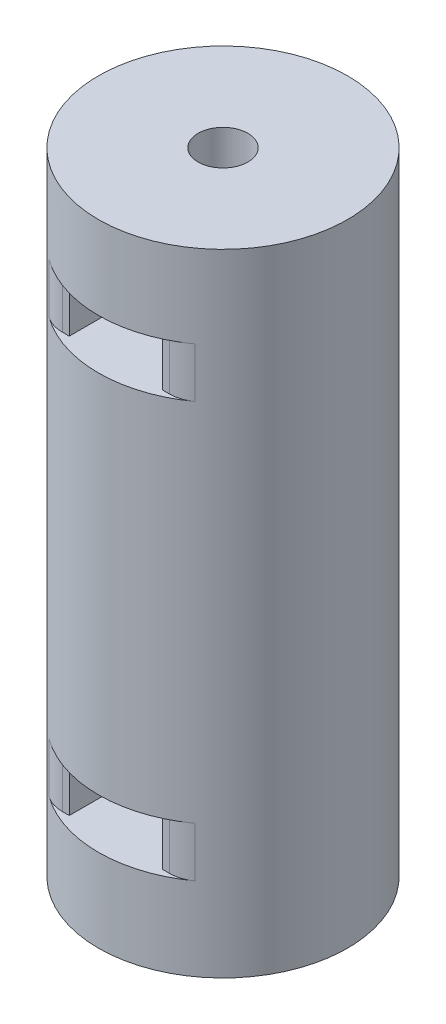
ISO-10303-21;
HEADER;
FILE_DESCRIPTION(('STEP AP214'),'2;1');
FILE_NAME('part.step','',(''),(''),'','','');
FILE_SCHEMA(('AUTOMOTIVE_DESIGN { 1 0 10303 214 1 1 1 1 }'));
ENDSEC;
DATA;
#1=APPLICATION_CONTEXT('core data for automotive mechanical design processes');
#2=APPLICATION_PROTOCOL_DEFINITION('international standard','automotive_design',2000,#1);
#3=PRODUCT_CONTEXT('',#1,'mechanical');
#4=PRODUCT('Part','Part','',(#3));
#5=PRODUCT_RELATED_PRODUCT_CATEGORY('part','',(#4));
#6=PRODUCT_DEFINITION_FORMATION('','',#4);
#7=PRODUCT_DEFINITION_CONTEXT('part definition',#1,'design');
#8=PRODUCT_DEFINITION('design','',#6,#7);
#9=PRODUCT_DEFINITION_SHAPE('','',#8);
#10=(LENGTH_UNIT() NAMED_UNIT(*) SI_UNIT(.MILLI.,.METRE.));
#11=(NAMED_UNIT(*) PLANE_ANGLE_UNIT() SI_UNIT($,.RADIAN.));
#12=(NAMED_UNIT(*) SI_UNIT($,.STERADIAN.) SOLID_ANGLE_UNIT());
#13=UNCERTAINTY_MEASURE_WITH_UNIT(LENGTH_MEASURE(1.E-05),#10,'distance_accuracy_value','');
#14=(GEOMETRIC_REPRESENTATION_CONTEXT(3) GLOBAL_UNCERTAINTY_ASSIGNED_CONTEXT((#13)) GLOBAL_UNIT_ASSIGNED_CONTEXT((#10,
#11,#12)) REPRESENTATION_CONTEXT('',''));
#15=CARTESIAN_POINT('',(0.,0.,0.));
#16=DIRECTION('',(0.,0.,1.));
#17=DIRECTION('',(1.,0.,0.));
#18=AXIS2_PLACEMENT_3D('',#15,#16,#17);
#19=CARTESIAN_POINT('',(0.,38.,0.));
#20=DIRECTION('',(0.,-1.,0.));
#21=DIRECTION('',(0.,0.,-1.));
#22=AXIS2_PLACEMENT_3D('',#19,#20,#21);
#23=CYLINDRICAL_SURFACE('',#22,7.5);
#24=CARTESIAN_POINT('',(0.,38.,0.));
#25=DIRECTION('',(0.,1.,0.));
#26=DIRECTION('',(0.,0.,1.));
#27=AXIS2_PLACEMENT_3D('',#24,#25,#26);
#28=CIRCLE('',#27,7.5);
#29=CARTESIAN_POINT('',(0.,38.,7.5));
#30=VERTEX_POINT('',#29);
#31=EDGE_CURVE('E264',#30,#30,#28,.T.);
#32=ORIENTED_EDGE('',*,*,#31,.F.);
#33=EDGE_LOOP('',(#32));
#34=FACE_BOUND('',#33,.T.);
#35=CARTESIAN_POINT('',(0.,0.,0.));
#36=DIRECTION('',(0.,1.,0.));
#37=DIRECTION('',(0.,0.,1.));
#38=AXIS2_PLACEMENT_3D('',#35,#36,#37);
#39=CIRCLE('',#38,7.5);
#40=CARTESIAN_POINT('',(0.,0.,7.5));
#41=VERTEX_POINT('',#40);
#42=EDGE_CURVE('E260',#41,#41,#39,.T.);
#43=ORIENTED_EDGE('',*,*,#42,.T.);
#44=EDGE_LOOP('',(#43));
#45=FACE_BOUND('',#44,.T.);
#46=DIRECTION('',(0.,-1.,0.));
#47=VECTOR('',#46,1.);
#48=CARTESIAN_POINT('',(-4.39307842521377,38.,6.07872206552671));
#49=LINE('',#48,#47);
#50=CARTESIAN_POINT('',(-4.39307842521377,30.,6.07872206552671));
#51=VERTEX_POINT('',#50);
#52=CARTESIAN_POINT('',(-4.39307842521377,33.,6.07872206552671));
#53=VERTEX_POINT('',#52);
#54=EDGE_CURVE('E286',#51,#53,#49,.F.);
#55=ORIENTED_EDGE('',*,*,#54,.T.);
#56=CARTESIAN_POINT('',(0.,33.,0.));
#57=DIRECTION('',(0.,-1.,0.));
#58=DIRECTION('',(0.,0.,-1.));
#59=AXIS2_PLACEMENT_3D('',#56,#57,#58);
#60=CIRCLE('',#59,7.5);
#61=CARTESIAN_POINT('',(4.39307842521378,33.,6.0787220655267));
#62=VERTEX_POINT('',#61);
#63=EDGE_CURVE('E252',#62,#53,#60,.T.);
#64=ORIENTED_EDGE('',*,*,#63,.F.);
#65=DIRECTION('',(0.,-1.,0.));
#66=VECTOR('',#65,1.);
#67=CARTESIAN_POINT('',(4.39307842521378,38.,6.0787220655267));
#68=LINE('',#67,#66);
#69=CARTESIAN_POINT('',(4.39307842521378,30.,6.0787220655267));
#70=VERTEX_POINT('',#69);
#71=EDGE_CURVE('E283',#62,#70,#68,.T.);
#72=ORIENTED_EDGE('',*,*,#71,.T.);
#73=CARTESIAN_POINT('',(0.,30.,0.));
#74=DIRECTION('',(0.,-1.,0.));
#75=DIRECTION('',(0.,0.,-1.));
#76=AXIS2_PLACEMENT_3D('',#73,#74,#75);
#77=CIRCLE('',#76,7.5);
#78=EDGE_CURVE('E255',#70,#51,#77,.T.);
#79=ORIENTED_EDGE('',*,*,#78,.T.);
#80=EDGE_LOOP('',(#55,#64,#72,#79));
#81=FACE_BOUND('',#80,.T.);
#82=DIRECTION('',(0.,-1.,0.));
#83=VECTOR('',#82,1.);
#84=CARTESIAN_POINT('',(4.39307842521378,38.,-6.0787220655267));
#85=LINE('',#84,#83);
#86=CARTESIAN_POINT('',(4.39307842521378,30.,-6.0787220655267));
#87=VERTEX_POINT('',#86);
#88=CARTESIAN_POINT('',(4.39307842521378,33.,-6.0787220655267));
#89=VERTEX_POINT('',#88);
#90=EDGE_CURVE('E292',#87,#89,#85,.F.);
#91=ORIENTED_EDGE('',*,*,#90,.T.);
#92=CARTESIAN_POINT('',(-4.39307842521378,33.,-6.0787220655267));
#93=VERTEX_POINT('',#92);
#94=EDGE_CURVE('E250',#93,#89,#60,.T.);
#95=ORIENTED_EDGE('',*,*,#94,.F.);
#96=DIRECTION('',(0.,-1.,0.));
#97=VECTOR('',#96,1.);
#98=CARTESIAN_POINT('',(-4.39307842521378,38.,-6.0787220655267));
#99=LINE('',#98,#97);
#100=CARTESIAN_POINT('',(-4.39307842521378,30.,-6.0787220655267));
#101=VERTEX_POINT('',#100);
#102=EDGE_CURVE('E289',#93,#101,#99,.T.);
#103=ORIENTED_EDGE('',*,*,#102,.T.);
#104=EDGE_CURVE('E253',#101,#87,#77,.T.);
#105=ORIENTED_EDGE('',*,*,#104,.T.);
#106=EDGE_LOOP('',(#91,#95,#103,#105));
#107=FACE_BOUND('',#106,.T.);
#108=DIRECTION('',(0.,-1.,0.));
#109=VECTOR('',#108,1.);
#110=CARTESIAN_POINT('',(4.39307842521378,38.,6.0787220655267));
#111=LINE('',#110,#109);
#112=CARTESIAN_POINT('',(4.39307842521378,8.,6.0787220655267));
#113=VERTEX_POINT('',#112);
#114=CARTESIAN_POINT('',(4.39307842521378,5.,6.0787220655267));
#115=VERTEX_POINT('',#114);
#116=EDGE_CURVE('E280',#113,#115,#111,.T.);
#117=ORIENTED_EDGE('',*,*,#116,.T.);
#118=CARTESIAN_POINT('',(0.,5.,0.));
#119=DIRECTION('',(0.,-1.,0.));
#120=DIRECTION('',(0.,0.,-1.));
#121=AXIS2_PLACEMENT_3D('',#118,#119,#120);
#122=CIRCLE('',#121,7.5);
#123=CARTESIAN_POINT('',(-4.39307842521377,5.,6.07872206552671));
#124=VERTEX_POINT('',#123);
#125=EDGE_CURVE('E231',#115,#124,#122,.T.);
#126=ORIENTED_EDGE('',*,*,#125,.T.);
#127=DIRECTION('',(0.,-1.,0.));
#128=VECTOR('',#127,1.);
#129=CARTESIAN_POINT('',(-4.39307842521377,38.,6.07872206552671));
#130=LINE('',#129,#128);
#131=CARTESIAN_POINT('',(-4.39307842521377,8.,6.07872206552671));
#132=VERTEX_POINT('',#131);
#133=EDGE_CURVE('E267',#124,#132,#130,.F.);
#134=ORIENTED_EDGE('',*,*,#133,.T.);
#135=CARTESIAN_POINT('',(0.,8.,0.));
#136=DIRECTION('',(0.,-1.,0.));
#137=DIRECTION('',(0.,0.,-1.));
#138=AXIS2_PLACEMENT_3D('',#135,#136,#137);
#139=CIRCLE('',#138,7.5);
#140=EDGE_CURVE('E235',#113,#132,#139,.T.);
#141=ORIENTED_EDGE('',*,*,#140,.F.);
#142=EDGE_LOOP('',(#117,#126,#134,#141));
#143=FACE_BOUND('',#142,.T.);
#144=DIRECTION('',(0.,-1.,0.));
#145=VECTOR('',#144,1.);
#146=CARTESIAN_POINT('',(-4.39307842521378,38.,-6.0787220655267));
#147=LINE('',#146,#145);
#148=CARTESIAN_POINT('',(-4.39307842521378,8.,-6.0787220655267));
#149=VERTEX_POINT('',#148);
#150=CARTESIAN_POINT('',(-4.39307842521378,5.,-6.0787220655267));
#151=VERTEX_POINT('',#150);
#152=EDGE_CURVE('E298',#149,#151,#147,.T.);
#153=ORIENTED_EDGE('',*,*,#152,.T.);
#154=CARTESIAN_POINT('',(4.39307842521378,5.,-6.0787220655267));
#155=VERTEX_POINT('',#154);
#156=EDGE_CURVE('E229',#151,#155,#122,.T.);
#157=ORIENTED_EDGE('',*,*,#156,.T.);
#158=DIRECTION('',(0.,-1.,0.));
#159=VECTOR('',#158,1.);
#160=CARTESIAN_POINT('',(4.39307842521378,38.,-6.0787220655267));
#161=LINE('',#160,#159);
#162=CARTESIAN_POINT('',(4.39307842521378,8.,-6.0787220655267));
#163=VERTEX_POINT('',#162);
#164=EDGE_CURVE('E295',#155,#163,#161,.F.);
#165=ORIENTED_EDGE('',*,*,#164,.T.);
#166=EDGE_CURVE('E233',#149,#163,#139,.T.);
#167=ORIENTED_EDGE('',*,*,#166,.F.);
#168=EDGE_LOOP('',(#153,#157,#165,#167));
#169=FACE_BOUND('',#168,.T.);
#170=ADVANCED_FACE('F33',(#34,#45,#81,#107,#143,#169),#23,.T.);
#171=CARTESIAN_POINT('',(0.,38.,0.));
#172=DIRECTION('',(0.,-1.,0.));
#173=DIRECTION('',(0.,0.,-1.));
#174=AXIS2_PLACEMENT_3D('',#171,#172,#173);
#175=CYLINDRICAL_SURFACE('',#174,1.5);
#176=CARTESIAN_POINT('',(0.,30.,0.));
#177=DIRECTION('',(0.,-1.,0.));
#178=DIRECTION('',(0.,0.,-1.));
#179=AXIS2_PLACEMENT_3D('',#176,#177,#178);
#180=CIRCLE('',#179,1.5);
#181=CARTESIAN_POINT('',(0.,30.,-1.5));
#182=VERTEX_POINT('',#181);
#183=EDGE_CURVE('E256',#182,#182,#180,.T.);
#184=ORIENTED_EDGE('',*,*,#183,.F.);
#185=EDGE_LOOP('',(#184));
#186=FACE_BOUND('',#185,.T.);
#187=CARTESIAN_POINT('',(0.,8.,0.));
#188=DIRECTION('',(0.,-1.,0.));
#189=DIRECTION('',(0.,0.,-1.));
#190=AXIS2_PLACEMENT_3D('',#187,#188,#189);
#191=CIRCLE('',#190,1.5);
#192=CARTESIAN_POINT('',(0.,8.,-1.5));
#193=VERTEX_POINT('',#192);
#194=EDGE_CURVE('E236',#193,#193,#191,.T.);
#195=ORIENTED_EDGE('',*,*,#194,.T.);
#196=EDGE_LOOP('',(#195));
#197=FACE_BOUND('',#196,.T.);
#198=ADVANCED_FACE('F438',(#186,#197),#175,.F.);
#199=CARTESIAN_POINT('',(0.,38.,0.));
#200=DIRECTION('',(0.,1.,0.));
#201=DIRECTION('',(0.,0.,1.));
#202=AXIS2_PLACEMENT_3D('',#199,#200,#201);
#203=CIRCLE('',#202,1.5);
#204=CARTESIAN_POINT('',(0.,38.,1.5));
#205=VERTEX_POINT('',#204);
#206=EDGE_CURVE('E257',#205,#205,#203,.T.);
#207=ORIENTED_EDGE('',*,*,#206,.T.);
#208=EDGE_LOOP('',(#207));
#209=FACE_BOUND('',#208,.T.);
#210=CARTESIAN_POINT('',(0.,33.,0.));
#211=DIRECTION('',(0.,-1.,0.));
#212=DIRECTION('',(0.,0.,-1.));
#213=AXIS2_PLACEMENT_3D('',#210,#211,#212);
#214=CIRCLE('',#213,1.5);
#215=CARTESIAN_POINT('',(0.,33.,-1.5));
#216=VERTEX_POINT('',#215);
#217=EDGE_CURVE('E244',#216,#216,#214,.T.);
#218=ORIENTED_EDGE('',*,*,#217,.T.);
#219=EDGE_LOOP('',(#218));
#220=FACE_BOUND('',#219,.T.);
#221=ADVANCED_FACE('F444',(#209,#220),#175,.F.);
#222=CARTESIAN_POINT('',(0.,38.,0.));
#223=DIRECTION('',(0.,1.,0.));
#224=DIRECTION('',(0.,0.,1.));
#225=AXIS2_PLACEMENT_3D('',#222,#223,#224);
#226=PLANE('',#225);
#227=ORIENTED_EDGE('',*,*,#31,.T.);
#228=EDGE_LOOP('',(#227));
#229=FACE_BOUND('',#228,.T.);
#230=ORIENTED_EDGE('',*,*,#206,.F.);
#231=EDGE_LOOP('',(#230));
#232=FACE_BOUND('',#231,.T.);
#233=ADVANCED_FACE('F684',(#229,#232),#226,.T.);
#234=CARTESIAN_POINT('',(0.,0.,0.));
#235=DIRECTION('',(0.,1.,0.));
#236=DIRECTION('',(0.,0.,1.));
#237=AXIS2_PLACEMENT_3D('',#234,#235,#236);
#238=PLANE('',#237);
#239=ORIENTED_EDGE('',*,*,#42,.F.);
#240=EDGE_LOOP('',(#239));
#241=FACE_BOUND('',#240,.T.);
#242=CARTESIAN_POINT('',(0.,0.,0.));
#243=DIRECTION('',(0.,1.,0.));
#244=DIRECTION('',(0.,0.,1.));
#245=AXIS2_PLACEMENT_3D('',#242,#243,#244);
#246=CIRCLE('',#245,1.5);
#247=CARTESIAN_POINT('',(0.,0.,1.5));
#248=VERTEX_POINT('',#247);
#249=EDGE_CURVE('E261',#248,#248,#246,.T.);
#250=ORIENTED_EDGE('',*,*,#249,.T.);
#251=EDGE_LOOP('',(#250));
#252=FACE_BOUND('',#251,.T.);
#253=ADVANCED_FACE('F452',(#241,#252),#238,.F.);
#254=CARTESIAN_POINT('',(0.,5.,0.));
#255=DIRECTION('',(0.,-1.,0.));
#256=DIRECTION('',(0.,0.,-1.));
#257=AXIS2_PLACEMENT_3D('',#254,#255,#256);
#258=CIRCLE('',#257,1.5);
#259=CARTESIAN_POINT('',(0.,5.,-1.5));
#260=VERTEX_POINT('',#259);
#261=EDGE_CURVE('E232',#260,#260,#258,.T.);
#262=ORIENTED_EDGE('',*,*,#261,.F.);
#263=EDGE_LOOP('',(#262));
#264=FACE_BOUND('',#263,.T.);
#265=ORIENTED_EDGE('',*,*,#249,.F.);
#266=EDGE_LOOP('',(#265));
#267=FACE_BOUND('',#266,.T.);
#268=ADVANCED_FACE('F447',(#264,#267),#175,.F.);
#269=CARTESIAN_POINT('',(2.8,30.,8.88226923120371));
#270=DIRECTION('',(1.,0.,0.));
#271=DIRECTION('',(0.,0.,-1.));
#272=AXIS2_PLACEMENT_3D('',#269,#270,#271);
#273=PLANE('',#272);
#274=DIRECTION('',(0.,0.,-1.));
#275=VECTOR('',#274,1.);
#276=CARTESIAN_POINT('',(2.8,33.,8.88226923120371));
#277=LINE('',#276,#275);
#278=CARTESIAN_POINT('',(2.8,33.,6.45772951471958));
#279=VERTEX_POINT('',#278);
#280=CARTESIAN_POINT('',(2.8,33.,-6.45772951471958));
#281=VERTEX_POINT('',#280);
#282=EDGE_CURVE('E245',#279,#281,#277,.T.);
#283=ORIENTED_EDGE('',*,*,#282,.T.);
#284=DIRECTION('',(0.,-1.,0.));
#285=VECTOR('',#284,1.);
#286=CARTESIAN_POINT('',(2.8,30.,-6.45772951471958));
#287=LINE('',#286,#285);
#288=CARTESIAN_POINT('',(2.8,30.,-6.45772951471958));
#289=VERTEX_POINT('',#288);
#290=EDGE_CURVE('E218',#281,#289,#287,.T.);
#291=ORIENTED_EDGE('',*,*,#290,.T.);
#292=DIRECTION('',(0.,0.,-1.));
#293=VECTOR('',#292,1.);
#294=CARTESIAN_POINT('',(2.8,30.,8.88226923120371));
#295=LINE('',#294,#293);
#296=CARTESIAN_POINT('',(2.8,30.,6.45772951471958));
#297=VERTEX_POINT('',#296);
#298=EDGE_CURVE('E237',#297,#289,#295,.T.);
#299=ORIENTED_EDGE('',*,*,#298,.F.);
#300=DIRECTION('',(0.,1.,0.));
#301=VECTOR('',#300,1.);
#302=CARTESIAN_POINT('',(2.8,30.,6.45772951471958));
#303=LINE('',#302,#301);
#304=EDGE_CURVE('E397',#297,#279,#303,.T.);
#305=ORIENTED_EDGE('',*,*,#304,.T.);
#306=EDGE_LOOP('',(#283,#291,#299,#305));
#307=FACE_BOUND('',#306,.T.);
#308=ADVANCED_FACE('F650',(#307),#273,.F.);
#309=CARTESIAN_POINT('',(-2.8,30.,8.88226923120371));
#310=DIRECTION('',(-1.,0.,0.));
#311=DIRECTION('',(0.,0.,1.));
#312=AXIS2_PLACEMENT_3D('',#309,#310,#311);
#313=PLANE('',#312);
#314=DIRECTION('',(0.,0.,1.));
#315=VECTOR('',#314,1.);
#316=CARTESIAN_POINT('',(-2.8,30.,8.88226923120371));
#317=LINE('',#316,#315);
#318=CARTESIAN_POINT('',(-2.8,30.,-6.45772951471958));
#319=VERTEX_POINT('',#318);
#320=CARTESIAN_POINT('',(-2.8,30.,6.45772951471958));
#321=VERTEX_POINT('',#320);
#322=EDGE_CURVE('E240',#319,#321,#317,.T.);
#323=ORIENTED_EDGE('',*,*,#322,.F.);
#324=DIRECTION('',(0.,1.,0.));
#325=VECTOR('',#324,1.);
#326=CARTESIAN_POINT('',(-2.8,30.,-6.45772951471958));
#327=LINE('',#326,#325);
#328=CARTESIAN_POINT('',(-2.8,33.,-6.45772951471958));
#329=VERTEX_POINT('',#328);
#330=EDGE_CURVE('E223',#319,#329,#327,.T.);
#331=ORIENTED_EDGE('',*,*,#330,.T.);
#332=DIRECTION('',(0.,0.,1.));
#333=VECTOR('',#332,1.);
#334=CARTESIAN_POINT('',(-2.8,33.,8.88226923120371));
#335=LINE('',#334,#333);
#336=CARTESIAN_POINT('',(-2.8,33.,6.45772951471958));
#337=VERTEX_POINT('',#336);
#338=EDGE_CURVE('E241',#329,#337,#335,.T.);
#339=ORIENTED_EDGE('',*,*,#338,.T.);
#340=DIRECTION('',(0.,-1.,0.));
#341=VECTOR('',#340,1.);
#342=CARTESIAN_POINT('',(-2.8,30.,6.45772951471958));
#343=LINE('',#342,#341);
#344=EDGE_CURVE('E394',#337,#321,#343,.T.);
#345=ORIENTED_EDGE('',*,*,#344,.T.);
#346=EDGE_LOOP('',(#323,#331,#339,#345));
#347=FACE_BOUND('',#346,.T.);
#348=ADVANCED_FACE('F620',(#347),#313,.F.);
#349=CARTESIAN_POINT('',(0.,30.,0.));
#350=DIRECTION('',(0.,-1.,0.));
#351=DIRECTION('',(0.,0.,-1.));
#352=AXIS2_PLACEMENT_3D('',#349,#350,#351);
#353=PLANE('',#352);
#354=ORIENTED_EDGE('',*,*,#183,.T.);
#355=EDGE_LOOP('',(#354));
#356=FACE_BOUND('',#355,.T.);
#357=ORIENTED_EDGE('',*,*,#298,.T.);
#358=DIRECTION('',(1.,0.,0.));
#359=VECTOR('',#358,1.);
#360=CARTESIAN_POINT('',(-13.429067932936,30.,-6.45772951471958));
#361=LINE('',#360,#359);
#362=CARTESIAN_POINT('',(3.22159084515677,30.,-6.45772951471958));
#363=VERTEX_POINT('',#362);
#364=EDGE_CURVE('E379',#289,#363,#361,.T.);
#365=ORIENTED_EDGE('',*,*,#364,.T.);
#366=CARTESIAN_POINT('',(3.22159084515677,30.,-4.45772951471958));
#367=DIRECTION('',(0.,-1.,0.));
#368=DIRECTION('',(0.,0.,-1.));
#369=AXIS2_PLACEMENT_3D('',#366,#367,#368);
#370=CIRCLE('',#369,2.);
#371=EDGE_CURVE('E328',#363,#87,#370,.T.);
#372=ORIENTED_EDGE('',*,*,#371,.T.);
#373=ORIENTED_EDGE('',*,*,#104,.F.);
#374=CARTESIAN_POINT('',(-3.22159084515677,30.,-4.45772951471958));
#375=DIRECTION('',(0.,-1.,0.));
#376=DIRECTION('',(0.,0.,-1.));
#377=AXIS2_PLACEMENT_3D('',#374,#375,#376);
#378=CIRCLE('',#377,2.);
#379=CARTESIAN_POINT('',(-3.22159084515677,30.,-6.45772951471958));
#380=VERTEX_POINT('',#379);
#381=EDGE_CURVE('E331',#101,#380,#378,.T.);
#382=ORIENTED_EDGE('',*,*,#381,.T.);
#383=EDGE_CURVE('E382',#380,#319,#361,.T.);
#384=ORIENTED_EDGE('',*,*,#383,.T.);
#385=ORIENTED_EDGE('',*,*,#322,.T.);
#386=DIRECTION('',(-1.,0.,0.));
#387=VECTOR('',#386,1.);
#388=CARTESIAN_POINT('',(12.7205318213497,30.,6.45772951471958));
#389=LINE('',#388,#387);
#390=CARTESIAN_POINT('',(-3.22159084515677,30.,6.45772951471958));
#391=VERTEX_POINT('',#390);
#392=EDGE_CURVE('E388',#321,#391,#389,.T.);
#393=ORIENTED_EDGE('',*,*,#392,.T.);
#394=CARTESIAN_POINT('',(-3.22159084515677,30.,4.45772951471958));
#395=DIRECTION('',(0.,-1.,0.));
#396=DIRECTION('',(0.,0.,-1.));
#397=AXIS2_PLACEMENT_3D('',#394,#395,#396);
#398=CIRCLE('',#397,2.);
#399=EDGE_CURVE('E338',#391,#51,#398,.T.);
#400=ORIENTED_EDGE('',*,*,#399,.T.);
#401=ORIENTED_EDGE('',*,*,#78,.F.);
#402=CARTESIAN_POINT('',(3.22159084515677,30.,4.45772951471958));
#403=DIRECTION('',(0.,-1.,0.));
#404=DIRECTION('',(0.,0.,-1.));
#405=AXIS2_PLACEMENT_3D('',#402,#403,#404);
#406=CIRCLE('',#405,2.);
#407=CARTESIAN_POINT('',(3.22159084515677,30.,6.45772951471958));
#408=VERTEX_POINT('',#407);
#409=EDGE_CURVE('E341',#70,#408,#406,.T.);
#410=ORIENTED_EDGE('',*,*,#409,.T.);
#411=EDGE_CURVE('E387',#408,#297,#389,.T.);
#412=ORIENTED_EDGE('',*,*,#411,.T.);
#413=EDGE_LOOP('',(#357,#365,#372,#373,#382,#384,#385,#393,#400,#401,#410,#412));
#414=FACE_BOUND('',#413,.T.);
#415=ADVANCED_FACE('F609',(#356,#414),#353,.F.);
#416=CARTESIAN_POINT('',(0.,33.,0.));
#417=DIRECTION('',(0.,-1.,0.));
#418=DIRECTION('',(0.,0.,-1.));
#419=AXIS2_PLACEMENT_3D('',#416,#417,#418);
#420=PLANE('',#419);
#421=ORIENTED_EDGE('',*,*,#338,.F.);
#422=DIRECTION('',(1.,0.,0.));
#423=VECTOR('',#422,1.);
#424=CARTESIAN_POINT('',(-13.429067932936,33.,-6.45772951471958));
#425=LINE('',#424,#423);
#426=CARTESIAN_POINT('',(-3.22159084515677,33.,-6.45772951471958));
#427=VERTEX_POINT('',#426);
#428=EDGE_CURVE('E383',#427,#329,#425,.T.);
#429=ORIENTED_EDGE('',*,*,#428,.F.);
#430=CARTESIAN_POINT('',(-3.22159084515677,33.,-4.45772951471958));
#431=DIRECTION('',(0.,-1.,0.));
#432=DIRECTION('',(0.,0.,-1.));
#433=AXIS2_PLACEMENT_3D('',#430,#431,#432);
#434=CIRCLE('',#433,2.);
#435=EDGE_CURVE('E333',#427,#93,#434,.F.);
#436=ORIENTED_EDGE('',*,*,#435,.T.);
#437=ORIENTED_EDGE('',*,*,#94,.T.);
#438=CARTESIAN_POINT('',(3.22159084515677,33.,-4.45772951471958));
#439=DIRECTION('',(0.,-1.,0.));
#440=DIRECTION('',(0.,0.,-1.));
#441=AXIS2_PLACEMENT_3D('',#438,#439,#440);
#442=CIRCLE('',#441,2.);
#443=CARTESIAN_POINT('',(3.22159084515677,33.,-6.45772951471958));
#444=VERTEX_POINT('',#443);
#445=EDGE_CURVE('E326',#89,#444,#442,.F.);
#446=ORIENTED_EDGE('',*,*,#445,.T.);
#447=EDGE_CURVE('E384',#281,#444,#425,.T.);
#448=ORIENTED_EDGE('',*,*,#447,.F.);
#449=ORIENTED_EDGE('',*,*,#282,.F.);
#450=DIRECTION('',(-1.,0.,0.));
#451=VECTOR('',#450,1.);
#452=CARTESIAN_POINT('',(12.7205318213497,33.,6.45772951471958));
#453=LINE('',#452,#451);
#454=CARTESIAN_POINT('',(3.22159084515677,33.,6.45772951471958));
#455=VERTEX_POINT('',#454);
#456=EDGE_CURVE('E391',#455,#279,#453,.T.);
#457=ORIENTED_EDGE('',*,*,#456,.F.);
#458=CARTESIAN_POINT('',(3.22159084515677,33.,4.45772951471958));
#459=DIRECTION('',(0.,-1.,0.));
#460=DIRECTION('',(0.,0.,-1.));
#461=AXIS2_PLACEMENT_3D('',#458,#459,#460);
#462=CIRCLE('',#461,2.);
#463=EDGE_CURVE('E343',#455,#62,#462,.F.);
#464=ORIENTED_EDGE('',*,*,#463,.T.);
#465=ORIENTED_EDGE('',*,*,#63,.T.);
#466=CARTESIAN_POINT('',(-3.22159084515677,33.,4.45772951471958));
#467=DIRECTION('',(0.,-1.,0.));
#468=DIRECTION('',(0.,0.,-1.));
#469=AXIS2_PLACEMENT_3D('',#466,#467,#468);
#470=CIRCLE('',#469,2.);
#471=CARTESIAN_POINT('',(-3.22159084515677,33.,6.45772951471958));
#472=VERTEX_POINT('',#471);
#473=EDGE_CURVE('E336',#53,#472,#470,.F.);
#474=ORIENTED_EDGE('',*,*,#473,.T.);
#475=EDGE_CURVE('E378',#337,#472,#453,.T.);
#476=ORIENTED_EDGE('',*,*,#475,.F.);
#477=EDGE_LOOP('',(#421,#429,#436,#437,#446,#448,#449,#457,#464,#465,#474,#476));
#478=FACE_BOUND('',#477,.T.);
#479=ORIENTED_EDGE('',*,*,#217,.F.);
#480=EDGE_LOOP('',(#479));
#481=FACE_BOUND('',#480,.T.);
#482=ADVANCED_FACE('F605',(#478,#481),#420,.T.);
#483=CARTESIAN_POINT('',(-2.8,8.,8.88226923120371));
#484=DIRECTION('',(-1.,0.,0.));
#485=DIRECTION('',(0.,0.,1.));
#486=AXIS2_PLACEMENT_3D('',#483,#484,#485);
#487=PLANE('',#486);
#488=DIRECTION('',(0.,0.,-1.));
#489=VECTOR('',#488,1.);
#490=CARTESIAN_POINT('',(-2.8,5.,8.88226923120371));
#491=LINE('',#490,#489);
#492=CARTESIAN_POINT('',(-2.8,5.,6.45772951471958));
#493=VERTEX_POINT('',#492);
#494=CARTESIAN_POINT('',(-2.8,5.,-6.45772951471958));
#495=VERTEX_POINT('',#494);
#496=EDGE_CURVE('E206',#493,#495,#491,.T.);
#497=ORIENTED_EDGE('',*,*,#496,.T.);
#498=DIRECTION('',(0.,1.,0.));
#499=VECTOR('',#498,1.);
#500=CARTESIAN_POINT('',(-2.8,8.,-6.45772951471958));
#501=LINE('',#500,#499);
#502=CARTESIAN_POINT('',(-2.8,8.,-6.45772951471958));
#503=VERTEX_POINT('',#502);
#504=EDGE_CURVE('E376',#495,#503,#501,.T.);
#505=ORIENTED_EDGE('',*,*,#504,.T.);
#506=DIRECTION('',(0.,0.,-1.));
#507=VECTOR('',#506,1.);
#508=CARTESIAN_POINT('',(-2.8,8.,8.88226923120371));
#509=LINE('',#508,#507);
#510=CARTESIAN_POINT('',(-2.8,8.,6.45772951471958));
#511=VERTEX_POINT('',#510);
#512=EDGE_CURVE('E208',#511,#503,#509,.T.);
#513=ORIENTED_EDGE('',*,*,#512,.F.);
#514=DIRECTION('',(0.,-1.,0.));
#515=VECTOR('',#514,1.);
#516=CARTESIAN_POINT('',(-2.8,8.,6.45772951471958));
#517=LINE('',#516,#515);
#518=EDGE_CURVE('E194',#511,#493,#517,.T.);
#519=ORIENTED_EDGE('',*,*,#518,.T.);
#520=EDGE_LOOP('',(#497,#505,#513,#519));
#521=FACE_BOUND('',#520,.T.);
#522=ADVANCED_FACE('F204',(#521),#487,.F.);
#523=CARTESIAN_POINT('',(2.8,8.,-8.88226923120371));
#524=DIRECTION('',(1.,0.,0.));
#525=DIRECTION('',(0.,0.,-1.));
#526=AXIS2_PLACEMENT_3D('',#523,#524,#525);
#527=PLANE('',#526);
#528=DIRECTION('',(0.,0.,1.));
#529=VECTOR('',#528,1.);
#530=CARTESIAN_POINT('',(2.8,8.,-8.88226923120371));
#531=LINE('',#530,#529);
#532=CARTESIAN_POINT('',(2.8,8.,-6.45772951471958));
#533=VERTEX_POINT('',#532);
#534=CARTESIAN_POINT('',(2.8,8.,6.45772951471958));
#535=VERTEX_POINT('',#534);
#536=EDGE_CURVE('E226',#533,#535,#531,.T.);
#537=ORIENTED_EDGE('',*,*,#536,.F.);
#538=DIRECTION('',(0.,-1.,0.));
#539=VECTOR('',#538,1.);
#540=CARTESIAN_POINT('',(2.8,8.,-6.45772951471958));
#541=LINE('',#540,#539);
#542=CARTESIAN_POINT('',(2.8,5.,-6.45772951471958));
#543=VERTEX_POINT('',#542);
#544=EDGE_CURVE('E209',#533,#543,#541,.T.);
#545=ORIENTED_EDGE('',*,*,#544,.T.);
#546=DIRECTION('',(0.,0.,1.));
#547=VECTOR('',#546,1.);
#548=CARTESIAN_POINT('',(2.8,5.,-8.88226923120371));
#549=LINE('',#548,#547);
#550=CARTESIAN_POINT('',(2.8,5.,6.45772951471958));
#551=VERTEX_POINT('',#550);
#552=EDGE_CURVE('E217',#543,#551,#549,.T.);
#553=ORIENTED_EDGE('',*,*,#552,.T.);
#554=DIRECTION('',(0.,1.,0.));
#555=VECTOR('',#554,1.);
#556=CARTESIAN_POINT('',(2.8,8.,6.45772951471958));
#557=LINE('',#556,#555);
#558=EDGE_CURVE('E210',#551,#535,#557,.T.);
#559=ORIENTED_EDGE('',*,*,#558,.T.);
#560=EDGE_LOOP('',(#537,#545,#553,#559));
#561=FACE_BOUND('',#560,.T.);
#562=ADVANCED_FACE('F406',(#561),#527,.F.);
#563=CARTESIAN_POINT('',(0.,8.,0.));
#564=DIRECTION('',(0.,-1.,0.));
#565=DIRECTION('',(0.,0.,-1.));
#566=AXIS2_PLACEMENT_3D('',#563,#564,#565);
#567=PLANE('',#566);
#568=ORIENTED_EDGE('',*,*,#512,.T.);
#569=DIRECTION('',(-1.,0.,0.));
#570=VECTOR('',#569,1.);
#571=CARTESIAN_POINT('',(15.1347885283639,8.,-6.45772951471958));
#572=LINE('',#571,#570);
#573=CARTESIAN_POINT('',(-3.22159084515677,8.,-6.45772951471958));
#574=VERTEX_POINT('',#573);
#575=EDGE_CURVE('E412',#503,#574,#572,.T.);
#576=ORIENTED_EDGE('',*,*,#575,.T.);
#577=CARTESIAN_POINT('',(-3.22159084515677,8.,-4.45772951471958));
#578=DIRECTION('',(0.,-1.,0.));
#579=DIRECTION('',(0.,0.,-1.));
#580=AXIS2_PLACEMENT_3D('',#577,#578,#579);
#581=CIRCLE('',#580,2.);
#582=EDGE_CURVE('E318',#574,#149,#581,.F.);
#583=ORIENTED_EDGE('',*,*,#582,.T.);
#584=ORIENTED_EDGE('',*,*,#166,.T.);
#585=CARTESIAN_POINT('',(3.22159084515677,8.,-4.45772951471958));
#586=DIRECTION('',(0.,-1.,0.));
#587=DIRECTION('',(0.,0.,-1.));
#588=AXIS2_PLACEMENT_3D('',#585,#586,#587);
#589=CIRCLE('',#588,2.);
#590=CARTESIAN_POINT('',(3.22159084515677,8.,-6.45772951471958));
#591=VERTEX_POINT('',#590);
#592=EDGE_CURVE('E321',#163,#591,#589,.F.);
#593=ORIENTED_EDGE('',*,*,#592,.T.);
#594=EDGE_CURVE('E372',#591,#533,#572,.T.);
#595=ORIENTED_EDGE('',*,*,#594,.T.);
#596=ORIENTED_EDGE('',*,*,#536,.T.);
#597=DIRECTION('',(1.,0.,0.));
#598=VECTOR('',#597,1.);
#599=CARTESIAN_POINT('',(-10.8111992144869,8.,6.45772951471959));
#600=LINE('',#599,#598);
#601=CARTESIAN_POINT('',(3.22159084515677,8.,6.45772951471958));
#602=VERTEX_POINT('',#601);
#603=EDGE_CURVE('E199',#535,#602,#600,.T.);
#604=ORIENTED_EDGE('',*,*,#603,.T.);
#605=CARTESIAN_POINT('',(3.22159084515677,8.,4.45772951471958));
#606=DIRECTION('',(0.,-1.,0.));
#607=DIRECTION('',(0.,0.,-1.));
#608=AXIS2_PLACEMENT_3D('',#605,#606,#607);
#609=CIRCLE('',#608,2.);
#610=EDGE_CURVE('E348',#602,#113,#609,.F.);
#611=ORIENTED_EDGE('',*,*,#610,.T.);
#612=ORIENTED_EDGE('',*,*,#140,.T.);
#613=CARTESIAN_POINT('',(-3.22159084515677,8.,4.45772951471958));
#614=DIRECTION('',(0.,-1.,0.));
#615=DIRECTION('',(0.,0.,-1.));
#616=AXIS2_PLACEMENT_3D('',#613,#614,#615);
#617=CIRCLE('',#616,2.);
#618=CARTESIAN_POINT('',(-3.22159084515677,8.,6.45772951471958));
#619=VERTEX_POINT('',#618);
#620=EDGE_CURVE('E41',#132,#619,#617,.F.);
#621=ORIENTED_EDGE('',*,*,#620,.T.);
#622=EDGE_CURVE('E426',#619,#511,#600,.T.);
#623=ORIENTED_EDGE('',*,*,#622,.T.);
#624=EDGE_LOOP('',(#568,#576,#583,#584,#593,#595,#596,#604,#611,#612,#621,#623));
#625=FACE_BOUND('',#624,.T.);
#626=ORIENTED_EDGE('',*,*,#194,.F.);
#627=EDGE_LOOP('',(#626));
#628=FACE_BOUND('',#627,.T.);
#629=ADVANCED_FACE('F353',(#625,#628),#567,.T.);
#630=CARTESIAN_POINT('',(0.,5.,0.));
#631=DIRECTION('',(0.,-1.,0.));
#632=DIRECTION('',(0.,0.,-1.));
#633=AXIS2_PLACEMENT_3D('',#630,#631,#632);
#634=PLANE('',#633);
#635=ORIENTED_EDGE('',*,*,#261,.T.);
#636=EDGE_LOOP('',(#635));
#637=FACE_BOUND('',#636,.T.);
#638=ORIENTED_EDGE('',*,*,#552,.F.);
#639=DIRECTION('',(-1.,0.,0.));
#640=VECTOR('',#639,1.);
#641=CARTESIAN_POINT('',(15.1347885283639,5.,-6.45772951471958));
#642=LINE('',#641,#640);
#643=CARTESIAN_POINT('',(3.22159084515677,5.,-6.45772951471958));
#644=VERTEX_POINT('',#643);
#645=EDGE_CURVE('E408',#644,#543,#642,.T.);
#646=ORIENTED_EDGE('',*,*,#645,.F.);
#647=CARTESIAN_POINT('',(3.22159084515677,5.,-4.45772951471958));
#648=DIRECTION('',(0.,-1.,0.));
#649=DIRECTION('',(0.,0.,-1.));
#650=AXIS2_PLACEMENT_3D('',#647,#648,#649);
#651=CIRCLE('',#650,2.);
#652=EDGE_CURVE('E323',#644,#155,#651,.T.);
#653=ORIENTED_EDGE('',*,*,#652,.T.);
#654=ORIENTED_EDGE('',*,*,#156,.F.);
#655=CARTESIAN_POINT('',(-3.22159084515677,5.,-4.45772951471958));
#656=DIRECTION('',(0.,-1.,0.));
#657=DIRECTION('',(0.,0.,-1.));
#658=AXIS2_PLACEMENT_3D('',#655,#656,#657);
#659=CIRCLE('',#658,2.);
#660=CARTESIAN_POINT('',(-3.22159084515677,5.,-6.45772951471958));
#661=VERTEX_POINT('',#660);
#662=EDGE_CURVE('E316',#151,#661,#659,.T.);
#663=ORIENTED_EDGE('',*,*,#662,.T.);
#664=EDGE_CURVE('E215',#495,#661,#642,.T.);
#665=ORIENTED_EDGE('',*,*,#664,.F.);
#666=ORIENTED_EDGE('',*,*,#496,.F.);
#667=DIRECTION('',(1.,0.,0.));
#668=VECTOR('',#667,1.);
#669=CARTESIAN_POINT('',(-10.8111992144869,5.,6.45772951471959));
#670=LINE('',#669,#668);
#671=CARTESIAN_POINT('',(-3.22159084515677,5.,6.45772951471958));
#672=VERTEX_POINT('',#671);
#673=EDGE_CURVE('E191',#672,#493,#670,.T.);
#674=ORIENTED_EDGE('',*,*,#673,.F.);
#675=CARTESIAN_POINT('',(-3.22159084515677,5.,4.45772951471958));
#676=DIRECTION('',(0.,-1.,0.));
#677=DIRECTION('',(0.,0.,-1.));
#678=AXIS2_PLACEMENT_3D('',#675,#676,#677);
#679=CIRCLE('',#678,2.);
#680=EDGE_CURVE('E11',#672,#124,#679,.T.);
#681=ORIENTED_EDGE('',*,*,#680,.T.);
#682=ORIENTED_EDGE('',*,*,#125,.F.);
#683=CARTESIAN_POINT('',(3.22159084515677,5.,4.45772951471958));
#684=DIRECTION('',(0.,-1.,0.));
#685=DIRECTION('',(0.,0.,-1.));
#686=AXIS2_PLACEMENT_3D('',#683,#684,#685);
#687=CIRCLE('',#686,2.);
#688=CARTESIAN_POINT('',(3.22159084515677,5.,6.45772951471958));
#689=VERTEX_POINT('',#688);
#690=EDGE_CURVE('E346',#115,#689,#687,.T.);
#691=ORIENTED_EDGE('',*,*,#690,.T.);
#692=EDGE_CURVE('E200',#551,#689,#670,.T.);
#693=ORIENTED_EDGE('',*,*,#692,.F.);
#694=EDGE_LOOP('',(#638,#646,#653,#654,#663,#665,#666,#674,#681,#682,#691,#693));
#695=FACE_BOUND('',#694,.T.);
#696=ADVANCED_FACE('F213',(#637,#695),#634,.F.);
#697=CARTESIAN_POINT('',(12.7205318213497,30.,6.45772951471958));
#698=DIRECTION('',(0.,0.,-1.));
#699=DIRECTION('',(-1.,0.,0.));
#700=AXIS2_PLACEMENT_3D('',#697,#698,#699);
#701=PLANE('',#700);
#702=ORIENTED_EDGE('',*,*,#475,.T.);
#703=DIRECTION('',(0.,-1.,0.));
#704=VECTOR('',#703,1.);
#705=CARTESIAN_POINT('',(-3.22159084515677,30.,6.45772951471958));
#706=LINE('',#705,#704);
#707=EDGE_CURVE('E309',#472,#391,#706,.T.);
#708=ORIENTED_EDGE('',*,*,#707,.T.);
#709=ORIENTED_EDGE('',*,*,#392,.F.);
#710=ORIENTED_EDGE('',*,*,#344,.F.);
#711=EDGE_LOOP('',(#702,#708,#709,#710));
#712=FACE_BOUND('',#711,.T.);
#713=ADVANCED_FACE('F565',(#712),#701,.F.);
#714=CARTESIAN_POINT('',(-13.429067932936,30.,-6.45772951471958));
#715=DIRECTION('',(0.,0.,1.));
#716=DIRECTION('',(1.,0.,0.));
#717=AXIS2_PLACEMENT_3D('',#714,#715,#716);
#718=PLANE('',#717);
#719=ORIENTED_EDGE('',*,*,#383,.F.);
#720=DIRECTION('',(0.,-1.,0.));
#721=VECTOR('',#720,1.);
#722=CARTESIAN_POINT('',(-3.22159084515677,30.,-6.45772951471958));
#723=LINE('',#722,#721);
#724=EDGE_CURVE('E307',#380,#427,#723,.F.);
#725=ORIENTED_EDGE('',*,*,#724,.T.);
#726=ORIENTED_EDGE('',*,*,#428,.T.);
#727=ORIENTED_EDGE('',*,*,#330,.F.);
#728=EDGE_LOOP('',(#719,#725,#726,#727));
#729=FACE_BOUND('',#728,.T.);
#730=ADVANCED_FACE('F554',(#729),#718,.F.);
#731=ORIENTED_EDGE('',*,*,#411,.F.);
#732=DIRECTION('',(0.,-1.,0.));
#733=VECTOR('',#732,1.);
#734=CARTESIAN_POINT('',(3.22159084515677,30.,6.45772951471958));
#735=LINE('',#734,#733);
#736=EDGE_CURVE('E311',#408,#455,#735,.F.);
#737=ORIENTED_EDGE('',*,*,#736,.T.);
#738=ORIENTED_EDGE('',*,*,#456,.T.);
#739=ORIENTED_EDGE('',*,*,#304,.F.);
#740=EDGE_LOOP('',(#731,#737,#738,#739));
#741=FACE_BOUND('',#740,.T.);
#742=ADVANCED_FACE('F551',(#741),#701,.F.);
#743=ORIENTED_EDGE('',*,*,#447,.T.);
#744=DIRECTION('',(0.,-1.,0.));
#745=VECTOR('',#744,1.);
#746=CARTESIAN_POINT('',(3.22159084515677,30.,-6.45772951471958));
#747=LINE('',#746,#745);
#748=EDGE_CURVE('E305',#444,#363,#747,.T.);
#749=ORIENTED_EDGE('',*,*,#748,.T.);
#750=ORIENTED_EDGE('',*,*,#364,.F.);
#751=ORIENTED_EDGE('',*,*,#290,.F.);
#752=EDGE_LOOP('',(#743,#749,#750,#751));
#753=FACE_BOUND('',#752,.T.);
#754=ADVANCED_FACE('F435',(#753),#718,.F.);
#755=CARTESIAN_POINT('',(-10.8111992144869,8.,6.45772951471959));
#756=DIRECTION('',(0.,0.,-1.));
#757=DIRECTION('',(-1.,0.,0.));
#758=AXIS2_PLACEMENT_3D('',#755,#756,#757);
#759=PLANE('',#758);
#760=ORIENTED_EDGE('',*,*,#692,.T.);
#761=DIRECTION('',(0.,-1.,0.));
#762=VECTOR('',#761,1.);
#763=CARTESIAN_POINT('',(3.22159084515677,8.,6.45772951471958));
#764=LINE('',#763,#762);
#765=EDGE_CURVE('E313',#689,#602,#764,.F.);
#766=ORIENTED_EDGE('',*,*,#765,.T.);
#767=ORIENTED_EDGE('',*,*,#603,.F.);
#768=ORIENTED_EDGE('',*,*,#558,.F.);
#769=EDGE_LOOP('',(#760,#766,#767,#768));
#770=FACE_BOUND('',#769,.T.);
#771=ADVANCED_FACE('F367',(#770),#759,.F.);
#772=CARTESIAN_POINT('',(15.1347885283639,8.,-6.45772951471958));
#773=DIRECTION('',(0.,0.,1.));
#774=DIRECTION('',(1.,0.,0.));
#775=AXIS2_PLACEMENT_3D('',#772,#773,#774);
#776=PLANE('',#775);
#777=ORIENTED_EDGE('',*,*,#594,.F.);
#778=DIRECTION('',(0.,-1.,0.));
#779=VECTOR('',#778,1.);
#780=CARTESIAN_POINT('',(3.22159084515677,8.,-6.45772951471958));
#781=LINE('',#780,#779);
#782=EDGE_CURVE('E303',#591,#644,#781,.T.);
#783=ORIENTED_EDGE('',*,*,#782,.T.);
#784=ORIENTED_EDGE('',*,*,#645,.T.);
#785=ORIENTED_EDGE('',*,*,#544,.F.);
#786=EDGE_LOOP('',(#777,#783,#784,#785));
#787=FACE_BOUND('',#786,.T.);
#788=ADVANCED_FACE('F427',(#787),#776,.F.);
#789=ORIENTED_EDGE('',*,*,#622,.F.);
#790=DIRECTION('',(0.,-1.,0.));
#791=VECTOR('',#790,1.);
#792=CARTESIAN_POINT('',(-3.22159084515677,8.,6.45772951471958));
#793=LINE('',#792,#791);
#794=EDGE_CURVE('E54',#619,#672,#793,.T.);
#795=ORIENTED_EDGE('',*,*,#794,.T.);
#796=ORIENTED_EDGE('',*,*,#673,.T.);
#797=ORIENTED_EDGE('',*,*,#518,.F.);
#798=EDGE_LOOP('',(#789,#795,#796,#797));
#799=FACE_BOUND('',#798,.T.);
#800=ADVANCED_FACE('F193',(#799),#759,.F.);
#801=ORIENTED_EDGE('',*,*,#664,.T.);
#802=DIRECTION('',(0.,-1.,0.));
#803=VECTOR('',#802,1.);
#804=CARTESIAN_POINT('',(-3.22159084515677,8.,-6.45772951471958));
#805=LINE('',#804,#803);
#806=EDGE_CURVE('E301',#661,#574,#805,.F.);
#807=ORIENTED_EDGE('',*,*,#806,.T.);
#808=ORIENTED_EDGE('',*,*,#575,.F.);
#809=ORIENTED_EDGE('',*,*,#504,.F.);
#810=EDGE_LOOP('',(#801,#807,#808,#809));
#811=FACE_BOUND('',#810,.T.);
#812=ADVANCED_FACE('F424',(#811),#776,.F.);
#813=CARTESIAN_POINT('',(-3.22159084515677,38.,-4.45772951471958));
#814=DIRECTION('',(0.,-1.,0.));
#815=DIRECTION('',(0.,0.,-1.));
#816=AXIS2_PLACEMENT_3D('',#813,#814,#815);
#817=CYLINDRICAL_SURFACE('',#816,2.);
#818=ORIENTED_EDGE('',*,*,#582,.F.);
#819=ORIENTED_EDGE('',*,*,#806,.F.);
#820=ORIENTED_EDGE('',*,*,#662,.F.);
#821=ORIENTED_EDGE('',*,*,#152,.F.);
#822=EDGE_LOOP('',(#818,#819,#820,#821));
#823=FACE_BOUND('',#822,.T.);
#824=ADVANCED_FACE('F422',(#823),#817,.T.);
#825=CARTESIAN_POINT('',(3.22159084515677,38.,-4.45772951471958));
#826=DIRECTION('',(0.,-1.,0.));
#827=DIRECTION('',(0.,0.,-1.));
#828=AXIS2_PLACEMENT_3D('',#825,#826,#827);
#829=CYLINDRICAL_SURFACE('',#828,2.);
#830=ORIENTED_EDGE('',*,*,#652,.F.);
#831=ORIENTED_EDGE('',*,*,#782,.F.);
#832=ORIENTED_EDGE('',*,*,#592,.F.);
#833=ORIENTED_EDGE('',*,*,#164,.F.);
#834=EDGE_LOOP('',(#830,#831,#832,#833));
#835=FACE_BOUND('',#834,.T.);
#836=ADVANCED_FACE('F415',(#835),#829,.T.);
#837=CARTESIAN_POINT('',(3.22159084515677,38.,-4.45772951471958));
#838=DIRECTION('',(0.,-1.,0.));
#839=DIRECTION('',(0.,0.,-1.));
#840=AXIS2_PLACEMENT_3D('',#837,#838,#839);
#841=CYLINDRICAL_SURFACE('',#840,2.);
#842=ORIENTED_EDGE('',*,*,#371,.F.);
#843=ORIENTED_EDGE('',*,*,#748,.F.);
#844=ORIENTED_EDGE('',*,*,#445,.F.);
#845=ORIENTED_EDGE('',*,*,#90,.F.);
#846=EDGE_LOOP('',(#842,#843,#844,#845));
#847=FACE_BOUND('',#846,.T.);
#848=ADVANCED_FACE('F458',(#847),#841,.T.);
#849=CARTESIAN_POINT('',(-3.22159084515677,38.,-4.45772951471958));
#850=DIRECTION('',(0.,-1.,0.));
#851=DIRECTION('',(0.,0.,-1.));
#852=AXIS2_PLACEMENT_3D('',#849,#850,#851);
#853=CYLINDRICAL_SURFACE('',#852,2.);
#854=ORIENTED_EDGE('',*,*,#435,.F.);
#855=ORIENTED_EDGE('',*,*,#724,.F.);
#856=ORIENTED_EDGE('',*,*,#381,.F.);
#857=ORIENTED_EDGE('',*,*,#102,.F.);
#858=EDGE_LOOP('',(#854,#855,#856,#857));
#859=FACE_BOUND('',#858,.T.);
#860=ADVANCED_FACE('F461',(#859),#853,.T.);
#861=CARTESIAN_POINT('',(-3.22159084515677,38.,4.45772951471958));
#862=DIRECTION('',(0.,-1.,0.));
#863=DIRECTION('',(0.,0.,-1.));
#864=AXIS2_PLACEMENT_3D('',#861,#862,#863);
#865=CYLINDRICAL_SURFACE('',#864,2.);
#866=ORIENTED_EDGE('',*,*,#399,.F.);
#867=ORIENTED_EDGE('',*,*,#707,.F.);
#868=ORIENTED_EDGE('',*,*,#473,.F.);
#869=ORIENTED_EDGE('',*,*,#54,.F.);
#870=EDGE_LOOP('',(#866,#867,#868,#869));
#871=FACE_BOUND('',#870,.T.);
#872=ADVANCED_FACE('F465',(#871),#865,.T.);
#873=CARTESIAN_POINT('',(3.22159084515677,38.,4.45772951471958));
#874=DIRECTION('',(0.,-1.,0.));
#875=DIRECTION('',(0.,0.,-1.));
#876=AXIS2_PLACEMENT_3D('',#873,#874,#875);
#877=CYLINDRICAL_SURFACE('',#876,2.);
#878=ORIENTED_EDGE('',*,*,#463,.F.);
#879=ORIENTED_EDGE('',*,*,#736,.F.);
#880=ORIENTED_EDGE('',*,*,#409,.F.);
#881=ORIENTED_EDGE('',*,*,#71,.F.);
#882=EDGE_LOOP('',(#878,#879,#880,#881));
#883=FACE_BOUND('',#882,.T.);
#884=ADVANCED_FACE('F469',(#883),#877,.T.);
#885=CARTESIAN_POINT('',(3.22159084515677,38.,4.45772951471958));
#886=DIRECTION('',(0.,-1.,0.));
#887=DIRECTION('',(0.,0.,-1.));
#888=AXIS2_PLACEMENT_3D('',#885,#886,#887);
#889=CYLINDRICAL_SURFACE('',#888,2.);
#890=ORIENTED_EDGE('',*,*,#610,.F.);
#891=ORIENTED_EDGE('',*,*,#765,.F.);
#892=ORIENTED_EDGE('',*,*,#690,.F.);
#893=ORIENTED_EDGE('',*,*,#116,.F.);
#894=EDGE_LOOP('',(#890,#891,#892,#893));
#895=FACE_BOUND('',#894,.T.);
#896=ADVANCED_FACE('F359',(#895),#889,.T.);
#897=CARTESIAN_POINT('',(-3.22159084515677,38.,4.45772951471958));
#898=DIRECTION('',(0.,-1.,0.));
#899=DIRECTION('',(0.,0.,-1.));
#900=AXIS2_PLACEMENT_3D('',#897,#898,#899);
#901=CYLINDRICAL_SURFACE('',#900,2.);
#902=ORIENTED_EDGE('',*,*,#680,.F.);
#903=ORIENTED_EDGE('',*,*,#794,.F.);
#904=ORIENTED_EDGE('',*,*,#620,.F.);
#905=ORIENTED_EDGE('',*,*,#133,.F.);
#906=EDGE_LOOP('',(#902,#903,#904,#905));
#907=FACE_BOUND('',#906,.T.);
#908=ADVANCED_FACE('F35',(#907),#901,.T.);
#909=CLOSED_SHELL('',(#170,#198,#221,#233,#253,#268,#308,#348,#415,#482,#522,#562,#629,#696,
#713,#730,#742,#754,#771,#788,#800,#812,#824,#836,#848,#860,#872,#884,#896,#908));
#910=MANIFOLD_SOLID_BREP('B2',#909);
#911=ADVANCED_BREP_SHAPE_REPRESENTATION('',(#18,#910),#14);
#912=SHAPE_DEFINITION_REPRESENTATION(#9,#911);
ENDSEC;
END-ISO-10303-21;
